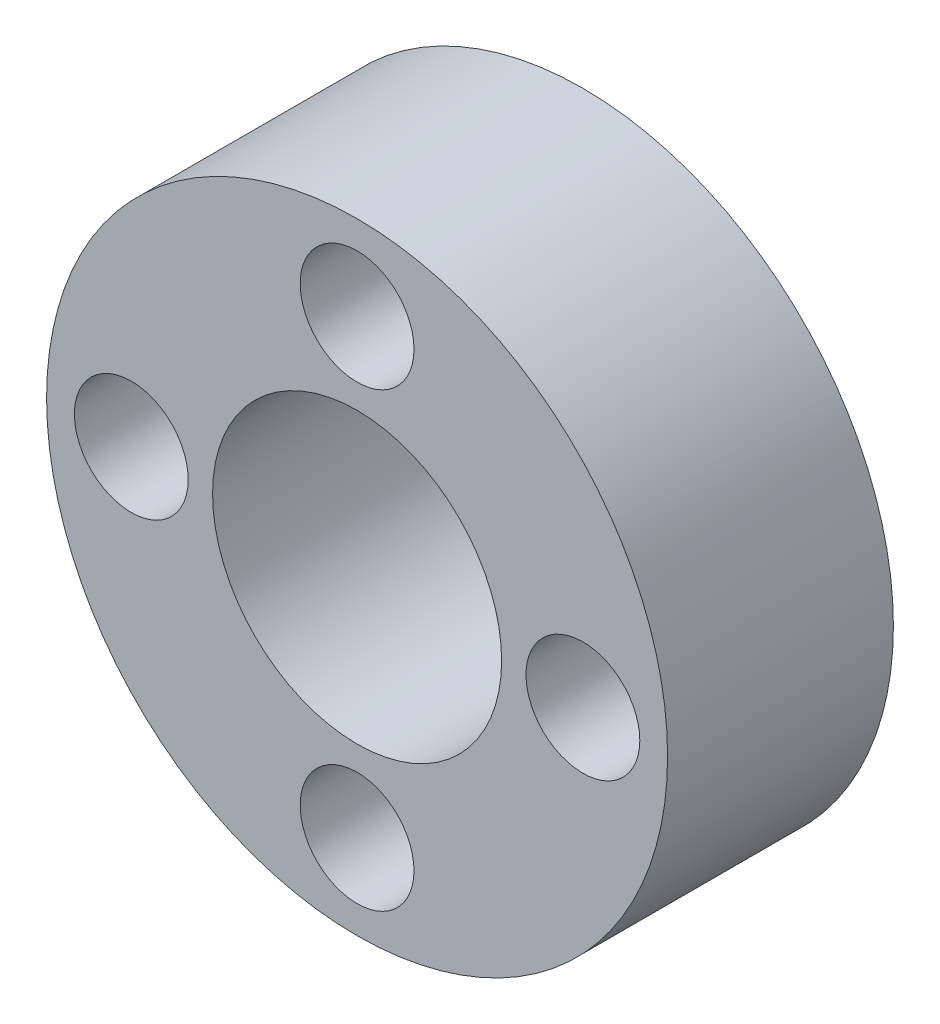
ISO-10303-21;
HEADER;
FILE_DESCRIPTION(('STEP AP214'),'2;1');
FILE_NAME('part.step','',(''),(''),'','','');
FILE_SCHEMA(('AUTOMOTIVE_DESIGN { 1 0 10303 214 1 1 1 1 }'));
ENDSEC;
DATA;
#1=APPLICATION_CONTEXT('core data for automotive mechanical design processes');
#2=APPLICATION_PROTOCOL_DEFINITION('international standard','automotive_design',2000,#1);
#3=PRODUCT_CONTEXT('',#1,'mechanical');
#4=PRODUCT('Part','Part','',(#3));
#5=PRODUCT_RELATED_PRODUCT_CATEGORY('part','',(#4));
#6=PRODUCT_DEFINITION_FORMATION('','',#4);
#7=PRODUCT_DEFINITION_CONTEXT('part definition',#1,'design');
#8=PRODUCT_DEFINITION('design','',#6,#7);
#9=PRODUCT_DEFINITION_SHAPE('','',#8);
#10=(LENGTH_UNIT() NAMED_UNIT(*) SI_UNIT(.MILLI.,.METRE.));
#11=(NAMED_UNIT(*) PLANE_ANGLE_UNIT() SI_UNIT($,.RADIAN.));
#12=(NAMED_UNIT(*) SI_UNIT($,.STERADIAN.) SOLID_ANGLE_UNIT());
#13=UNCERTAINTY_MEASURE_WITH_UNIT(LENGTH_MEASURE(1.E-05),#10,'distance_accuracy_value','');
#14=(GEOMETRIC_REPRESENTATION_CONTEXT(3) GLOBAL_UNCERTAINTY_ASSIGNED_CONTEXT((#13)) GLOBAL_UNIT_ASSIGNED_CONTEXT((#10,
#11,#12)) REPRESENTATION_CONTEXT('',''));
#15=CARTESIAN_POINT('',(0.,0.,0.));
#16=DIRECTION('',(0.,0.,1.));
#17=DIRECTION('',(1.,0.,0.));
#18=AXIS2_PLACEMENT_3D('',#15,#16,#17);
#19=CARTESIAN_POINT('',(0.,0.,0.));
#20=DIRECTION('',(0.,0.,1.));
#21=DIRECTION('',(1.,0.,0.));
#22=AXIS2_PLACEMENT_3D('',#19,#20,#21);
#23=PLANE('',#22);
#24=CARTESIAN_POINT('',(0.,0.,0.));
#25=DIRECTION('',(0.,0.,-1.));
#26=DIRECTION('',(-1.,0.,0.));
#27=AXIS2_PLACEMENT_3D('',#24,#25,#26);
#28=CIRCLE('',#27,4.064);
#29=CARTESIAN_POINT('',(-4.064,0.,0.));
#30=VERTEX_POINT('',#29);
#31=EDGE_CURVE('E106',#30,#30,#28,.T.);
#32=ORIENTED_EDGE('',*,*,#31,.F.);
#33=EDGE_LOOP('',(#32));
#34=FACE_BOUND('',#33,.T.);
#35=CARTESIAN_POINT('',(0.,6.35,0.));
#36=DIRECTION('',(0.,0.,1.));
#37=DIRECTION('',(1.,0.,0.));
#38=AXIS2_PLACEMENT_3D('',#35,#36,#37);
#39=CIRCLE('',#38,1.6);
#40=CARTESIAN_POINT('',(1.6,6.35,0.));
#41=VERTEX_POINT('',#40);
#42=EDGE_CURVE('E98',#41,#41,#39,.T.);
#43=ORIENTED_EDGE('',*,*,#42,.T.);
#44=EDGE_LOOP('',(#43));
#45=FACE_BOUND('',#44,.T.);
#46=CARTESIAN_POINT('',(6.35,0.,0.));
#47=DIRECTION('',(0.,0.,1.));
#48=DIRECTION('',(1.,0.,0.));
#49=AXIS2_PLACEMENT_3D('',#46,#47,#48);
#50=CIRCLE('',#49,1.6);
#51=CARTESIAN_POINT('',(7.95,0.,0.));
#52=VERTEX_POINT('',#51);
#53=EDGE_CURVE('E90',#52,#52,#50,.T.);
#54=ORIENTED_EDGE('',*,*,#53,.T.);
#55=EDGE_LOOP('',(#54));
#56=FACE_BOUND('',#55,.T.);
#57=CARTESIAN_POINT('',(0.,-6.35,0.));
#58=DIRECTION('',(0.,0.,1.));
#59=DIRECTION('',(1.,0.,0.));
#60=AXIS2_PLACEMENT_3D('',#57,#58,#59);
#61=CIRCLE('',#60,1.6);
#62=CARTESIAN_POINT('',(1.6,-6.35,0.));
#63=VERTEX_POINT('',#62);
#64=EDGE_CURVE('E82',#63,#63,#61,.T.);
#65=ORIENTED_EDGE('',*,*,#64,.T.);
#66=EDGE_LOOP('',(#65));
#67=FACE_BOUND('',#66,.T.);
#68=CARTESIAN_POINT('',(-6.35,0.,0.));
#69=DIRECTION('',(0.,0.,1.));
#70=DIRECTION('',(1.,0.,0.));
#71=AXIS2_PLACEMENT_3D('',#68,#69,#70);
#72=CIRCLE('',#71,1.6);
#73=CARTESIAN_POINT('',(-4.75,0.,0.));
#74=VERTEX_POINT('',#73);
#75=EDGE_CURVE('E73',#74,#74,#72,.T.);
#76=ORIENTED_EDGE('',*,*,#75,.T.);
#77=EDGE_LOOP('',(#76));
#78=FACE_BOUND('',#77,.T.);
#79=CARTESIAN_POINT('',(0.,0.,0.));
#80=DIRECTION('',(0.,0.,1.));
#81=DIRECTION('',(1.,0.,0.));
#82=AXIS2_PLACEMENT_3D('',#79,#80,#81);
#83=CIRCLE('',#82,8.73125);
#84=CARTESIAN_POINT('',(8.73125,0.,0.));
#85=VERTEX_POINT('',#84);
#86=EDGE_CURVE('E12',#85,#85,#83,.T.);
#87=ORIENTED_EDGE('',*,*,#86,.F.);
#88=EDGE_LOOP('',(#87));
#89=FACE_BOUND('',#88,.T.);
#90=ADVANCED_FACE('F58',(#34,#45,#56,#67,#78,#89),#23,.F.);
#91=CARTESIAN_POINT('',(0.,0.,15.875));
#92=DIRECTION('',(0.,0.,-1.));
#93=DIRECTION('',(-1.,0.,0.));
#94=AXIS2_PLACEMENT_3D('',#91,#92,#93);
#95=CYLINDRICAL_SURFACE('',#94,8.73125);
#96=ORIENTED_EDGE('',*,*,#86,.T.);
#97=EDGE_LOOP('',(#96));
#98=FACE_BOUND('',#97,.T.);
#99=CARTESIAN_POINT('',(0.,0.,6.35));
#100=DIRECTION('',(0.,0.,1.));
#101=DIRECTION('',(1.,0.,0.));
#102=AXIS2_PLACEMENT_3D('',#99,#100,#101);
#103=CIRCLE('',#102,8.73125);
#104=CARTESIAN_POINT('',(8.73125,0.,6.35));
#105=VERTEX_POINT('',#104);
#106=EDGE_CURVE('E67',#105,#105,#103,.T.);
#107=ORIENTED_EDGE('',*,*,#106,.F.);
#108=EDGE_LOOP('',(#107));
#109=FACE_BOUND('',#108,.T.);
#110=ADVANCED_FACE('F60',(#98,#109),#95,.T.);
#111=CARTESIAN_POINT('',(0.,0.,6.35));
#112=DIRECTION('',(0.,0.,1.));
#113=DIRECTION('',(1.,0.,0.));
#114=AXIS2_PLACEMENT_3D('',#111,#112,#113);
#115=PLANE('',#114);
#116=CARTESIAN_POINT('',(0.,0.,6.35));
#117=DIRECTION('',(0.,0.,1.));
#118=DIRECTION('',(1.,0.,0.));
#119=AXIS2_PLACEMENT_3D('',#116,#117,#118);
#120=CIRCLE('',#119,4.064);
#121=CARTESIAN_POINT('',(4.064,0.,6.35));
#122=VERTEX_POINT('',#121);
#123=EDGE_CURVE('E62',#122,#122,#120,.T.);
#124=ORIENTED_EDGE('',*,*,#123,.F.);
#125=EDGE_LOOP('',(#124));
#126=FACE_BOUND('',#125,.T.);
#127=CARTESIAN_POINT('',(0.,6.35,6.35));
#128=DIRECTION('',(0.,0.,1.));
#129=DIRECTION('',(1.,0.,0.));
#130=AXIS2_PLACEMENT_3D('',#127,#128,#129);
#131=CIRCLE('',#130,1.6);
#132=CARTESIAN_POINT('',(1.6,6.35,6.35));
#133=VERTEX_POINT('',#132);
#134=EDGE_CURVE('E102',#133,#133,#131,.T.);
#135=ORIENTED_EDGE('',*,*,#134,.F.);
#136=EDGE_LOOP('',(#135));
#137=FACE_BOUND('',#136,.T.);
#138=CARTESIAN_POINT('',(6.35,0.,6.35));
#139=DIRECTION('',(0.,0.,1.));
#140=DIRECTION('',(1.,0.,0.));
#141=AXIS2_PLACEMENT_3D('',#138,#139,#140);
#142=CIRCLE('',#141,1.6);
#143=CARTESIAN_POINT('',(7.95,0.,6.35));
#144=VERTEX_POINT('',#143);
#145=EDGE_CURVE('E94',#144,#144,#142,.T.);
#146=ORIENTED_EDGE('',*,*,#145,.F.);
#147=EDGE_LOOP('',(#146));
#148=FACE_BOUND('',#147,.T.);
#149=CARTESIAN_POINT('',(0.,-6.35,6.35));
#150=DIRECTION('',(0.,0.,1.));
#151=DIRECTION('',(1.,0.,0.));
#152=AXIS2_PLACEMENT_3D('',#149,#150,#151);
#153=CIRCLE('',#152,1.6);
#154=CARTESIAN_POINT('',(1.6,-6.35,6.35));
#155=VERTEX_POINT('',#154);
#156=EDGE_CURVE('E86',#155,#155,#153,.T.);
#157=ORIENTED_EDGE('',*,*,#156,.F.);
#158=EDGE_LOOP('',(#157));
#159=FACE_BOUND('',#158,.T.);
#160=CARTESIAN_POINT('',(-6.35,0.,6.35));
#161=DIRECTION('',(0.,0.,1.));
#162=DIRECTION('',(1.,0.,0.));
#163=AXIS2_PLACEMENT_3D('',#160,#161,#162);
#164=CIRCLE('',#163,1.6);
#165=CARTESIAN_POINT('',(-4.75,0.,6.35));
#166=VERTEX_POINT('',#165);
#167=EDGE_CURVE('E78',#166,#166,#164,.T.);
#168=ORIENTED_EDGE('',*,*,#167,.F.);
#169=EDGE_LOOP('',(#168));
#170=FACE_BOUND('',#169,.T.);
#171=ORIENTED_EDGE('',*,*,#106,.T.);
#172=EDGE_LOOP('',(#171));
#173=FACE_BOUND('',#172,.T.);
#174=ADVANCED_FACE('F117',(#126,#137,#148,#159,#170,#173),#115,.T.);
#175=CARTESIAN_POINT('',(-6.35,0.,6.35));
#176=DIRECTION('',(0.,0.,1.));
#177=DIRECTION('',(1.,0.,0.));
#178=AXIS2_PLACEMENT_3D('',#175,#176,#177);
#179=CYLINDRICAL_SURFACE('',#178,1.6);
#180=ORIENTED_EDGE('',*,*,#167,.T.);
#181=EDGE_LOOP('',(#180));
#182=FACE_BOUND('',#181,.T.);
#183=ORIENTED_EDGE('',*,*,#75,.F.);
#184=EDGE_LOOP('',(#183));
#185=FACE_BOUND('',#184,.T.);
#186=ADVANCED_FACE('F120',(#182,#185),#179,.F.);
#187=CARTESIAN_POINT('',(0.,-6.35,6.35));
#188=DIRECTION('',(0.,0.,1.));
#189=DIRECTION('',(1.,0.,0.));
#190=AXIS2_PLACEMENT_3D('',#187,#188,#189);
#191=CYLINDRICAL_SURFACE('',#190,1.6);
#192=ORIENTED_EDGE('',*,*,#156,.T.);
#193=EDGE_LOOP('',(#192));
#194=FACE_BOUND('',#193,.T.);
#195=ORIENTED_EDGE('',*,*,#64,.F.);
#196=EDGE_LOOP('',(#195));
#197=FACE_BOUND('',#196,.T.);
#198=ADVANCED_FACE('F145',(#194,#197),#191,.F.);
#199=CARTESIAN_POINT('',(6.35,0.,6.35));
#200=DIRECTION('',(0.,0.,1.));
#201=DIRECTION('',(1.,0.,0.));
#202=AXIS2_PLACEMENT_3D('',#199,#200,#201);
#203=CYLINDRICAL_SURFACE('',#202,1.6);
#204=ORIENTED_EDGE('',*,*,#145,.T.);
#205=EDGE_LOOP('',(#204));
#206=FACE_BOUND('',#205,.T.);
#207=ORIENTED_EDGE('',*,*,#53,.F.);
#208=EDGE_LOOP('',(#207));
#209=FACE_BOUND('',#208,.T.);
#210=ADVANCED_FACE('F149',(#206,#209),#203,.F.);
#211=CARTESIAN_POINT('',(0.,6.35,6.35));
#212=DIRECTION('',(0.,0.,1.));
#213=DIRECTION('',(1.,0.,0.));
#214=AXIS2_PLACEMENT_3D('',#211,#212,#213);
#215=CYLINDRICAL_SURFACE('',#214,1.6);
#216=ORIENTED_EDGE('',*,*,#134,.T.);
#217=EDGE_LOOP('',(#216));
#218=FACE_BOUND('',#217,.T.);
#219=ORIENTED_EDGE('',*,*,#42,.F.);
#220=EDGE_LOOP('',(#219));
#221=FACE_BOUND('',#220,.T.);
#222=ADVANCED_FACE('F153',(#218,#221),#215,.F.);
#223=CARTESIAN_POINT('',(0.,0.,7.17393878227254));
#224=DIRECTION('',(0.,0.,-1.));
#225=DIRECTION('',(-1.,0.,0.));
#226=AXIS2_PLACEMENT_3D('',#223,#224,#225);
#227=CYLINDRICAL_SURFACE('',#226,4.064);
#228=ORIENTED_EDGE('',*,*,#123,.T.);
#229=EDGE_LOOP('',(#228));
#230=FACE_BOUND('',#229,.T.);
#231=ORIENTED_EDGE('',*,*,#31,.T.);
#232=EDGE_LOOP('',(#231));
#233=FACE_BOUND('',#232,.T.);
#234=ADVANCED_FACE('F115',(#230,#233),#227,.F.);
#235=CLOSED_SHELL('',(#90,#110,#174,#186,#198,#210,#222,#234));
#236=MANIFOLD_SOLID_BREP('B2',#235);
#237=ADVANCED_BREP_SHAPE_REPRESENTATION('',(#18,#236),#14);
#238=SHAPE_DEFINITION_REPRESENTATION(#9,#237);
ENDSEC;
END-ISO-10303-21;
